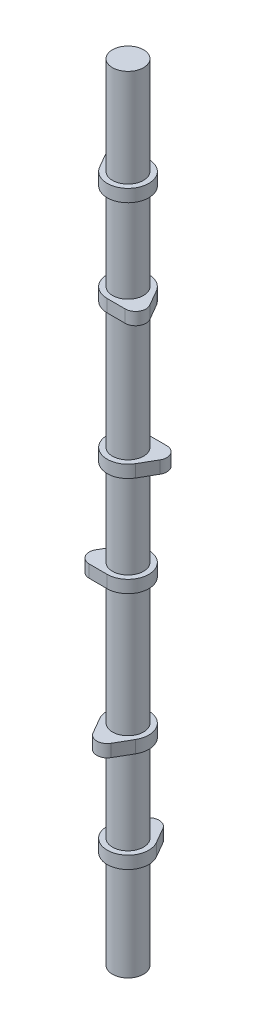
ISO-10303-21;
HEADER;
FILE_DESCRIPTION(('STEP AP214'),'2;1');
FILE_NAME('part.step','',(''),(''),'','','');
FILE_SCHEMA(('AUTOMOTIVE_DESIGN { 1 0 10303 214 1 1 1 1 }'));
ENDSEC;
DATA;
#1=APPLICATION_CONTEXT('core data for automotive mechanical design processes');
#2=APPLICATION_PROTOCOL_DEFINITION('international standard','automotive_design',2000,#1);
#3=PRODUCT_CONTEXT('',#1,'mechanical');
#4=PRODUCT('Part','Part','',(#3));
#5=PRODUCT_RELATED_PRODUCT_CATEGORY('part','',(#4));
#6=PRODUCT_DEFINITION_FORMATION('','',#4);
#7=PRODUCT_DEFINITION_CONTEXT('part definition',#1,'design');
#8=PRODUCT_DEFINITION('design','',#6,#7);
#9=PRODUCT_DEFINITION_SHAPE('','',#8);
#10=(LENGTH_UNIT() NAMED_UNIT(*) SI_UNIT(.MILLI.,.METRE.));
#11=(NAMED_UNIT(*) PLANE_ANGLE_UNIT() SI_UNIT($,.RADIAN.));
#12=(NAMED_UNIT(*) SI_UNIT($,.STERADIAN.) SOLID_ANGLE_UNIT());
#13=UNCERTAINTY_MEASURE_WITH_UNIT(LENGTH_MEASURE(1.E-05),#10,'distance_accuracy_value','');
#14=(GEOMETRIC_REPRESENTATION_CONTEXT(3) GLOBAL_UNCERTAINTY_ASSIGNED_CONTEXT((#13)) GLOBAL_UNIT_ASSIGNED_CONTEXT((#10,
#11,#12)) REPRESENTATION_CONTEXT('',''));
#15=CARTESIAN_POINT('',(0.,0.,0.));
#16=DIRECTION('',(0.,0.,1.));
#17=DIRECTION('',(1.,0.,0.));
#18=AXIS2_PLACEMENT_3D('',#15,#16,#17);
#19=CARTESIAN_POINT('',(0.,64.77,12.7));
#20=DIRECTION('',(0.,-1.,0.));
#21=DIRECTION('',(0.,0.,1.));
#22=AXIS2_PLACEMENT_3D('',#19,#20,#21);
#23=CYLINDRICAL_SURFACE('',#22,6.35);
#24=CARTESIAN_POINT('',(0.,57.15,12.7));
#25=DIRECTION('',(0.,1.,0.));
#26=DIRECTION('',(0.,0.,-1.));
#27=AXIS2_PLACEMENT_3D('',#24,#25,#26);
#28=CIRCLE('',#27,6.35);
#29=CARTESIAN_POINT('',(-5.4992613140313,57.15,15.875));
#30=VERTEX_POINT('',#29);
#31=CARTESIAN_POINT('',(5.49926131403107,57.15,15.875));
#32=VERTEX_POINT('',#31);
#33=EDGE_CURVE('E390',#30,#32,#28,.T.);
#34=ORIENTED_EDGE('',*,*,#33,.T.);
#35=DIRECTION('',(0.,-1.,0.));
#36=VECTOR('',#35,1.);
#37=CARTESIAN_POINT('',(5.49926131403107,64.77,15.875));
#38=LINE('',#37,#36);
#39=CARTESIAN_POINT('',(5.49926131403107,64.77,15.875));
#40=VERTEX_POINT('',#39);
#41=EDGE_CURVE('E47',#40,#32,#38,.T.);
#42=ORIENTED_EDGE('',*,*,#41,.F.);
#43=CARTESIAN_POINT('',(0.,64.77,12.7));
#44=DIRECTION('',(0.,1.,0.));
#45=DIRECTION('',(0.,0.,-1.));
#46=AXIS2_PLACEMENT_3D('',#43,#44,#45);
#47=CIRCLE('',#46,6.35);
#48=CARTESIAN_POINT('',(-5.4992613140313,64.77,15.875));
#49=VERTEX_POINT('',#48);
#50=EDGE_CURVE('E391',#49,#40,#47,.T.);
#51=ORIENTED_EDGE('',*,*,#50,.F.);
#52=DIRECTION('',(0.,-1.,0.));
#53=VECTOR('',#52,1.);
#54=CARTESIAN_POINT('',(-5.4992613140313,64.77,15.875));
#55=LINE('',#54,#53);
#56=EDGE_CURVE('E397',#49,#30,#55,.T.);
#57=ORIENTED_EDGE('',*,*,#56,.T.);
#58=EDGE_LOOP('',(#34,#42,#51,#57));
#59=FACE_BOUND('',#58,.T.);
#60=ADVANCED_FACE('F39',(#59),#23,.T.);
#61=CARTESIAN_POINT('',(5.49926131403107,64.77,15.875));
#62=DIRECTION('',(-0.866025403784435,0.,-0.500000000000006));
#63=DIRECTION('',(-0.500000000000006,0.,0.866025403784435));
#64=AXIS2_PLACEMENT_3D('',#61,#62,#63);
#65=PLANE('',#64);
#66=DIRECTION('',(0.500000000000006,0.,-0.866025403784435));
#67=VECTOR('',#66,1.);
#68=CARTESIAN_POINT('',(5.49926131403107,57.15,15.875));
#69=LINE('',#68,#67);
#70=CARTESIAN_POINT('',(10.9985226280623,57.15,6.35000000000008));
#71=VERTEX_POINT('',#70);
#72=EDGE_CURVE('E400',#32,#71,#69,.T.);
#73=ORIENTED_EDGE('',*,*,#72,.T.);
#74=DIRECTION('',(0.,-1.,0.));
#75=VECTOR('',#74,1.);
#76=CARTESIAN_POINT('',(10.9985226280623,64.77,6.35000000000008));
#77=LINE('',#76,#75);
#78=CARTESIAN_POINT('',(10.9985226280623,64.77,6.35000000000008));
#79=VERTEX_POINT('',#78);
#80=EDGE_CURVE('E407',#79,#71,#77,.T.);
#81=ORIENTED_EDGE('',*,*,#80,.F.);
#82=DIRECTION('',(0.500000000000006,0.,-0.866025403784435));
#83=VECTOR('',#82,1.);
#84=CARTESIAN_POINT('',(5.49926131403107,64.77,15.875));
#85=LINE('',#84,#83);
#86=EDGE_CURVE('E87',#40,#79,#85,.T.);
#87=ORIENTED_EDGE('',*,*,#86,.F.);
#88=ORIENTED_EDGE('',*,*,#41,.T.);
#89=EDGE_LOOP('',(#73,#81,#87,#88));
#90=FACE_BOUND('',#89,.T.);
#91=ADVANCED_FACE('F409',(#90),#65,.F.);
#92=CARTESIAN_POINT('',(0.,64.77,0.));
#93=DIRECTION('',(0.,-1.,0.));
#94=DIRECTION('',(0.,0.,1.));
#95=AXIS2_PLACEMENT_3D('',#92,#93,#94);
#96=CYLINDRICAL_SURFACE('',#95,12.7);
#97=CARTESIAN_POINT('',(0.,57.15,0.));
#98=DIRECTION('',(0.,1.,0.));
#99=DIRECTION('',(0.,0.,-1.));
#100=AXIS2_PLACEMENT_3D('',#97,#98,#99);
#101=CIRCLE('',#100,12.7);
#102=CARTESIAN_POINT('',(-10.9985226280624,57.15,6.34999999999992));
#103=VERTEX_POINT('',#102);
#104=EDGE_CURVE('E73',#71,#103,#101,.T.);
#105=ORIENTED_EDGE('',*,*,#104,.T.);
#106=DIRECTION('',(0.,-1.,0.));
#107=VECTOR('',#106,1.);
#108=CARTESIAN_POINT('',(-10.9985226280624,64.77,6.34999999999992));
#109=LINE('',#108,#107);
#110=CARTESIAN_POINT('',(-10.9985226280624,64.77,6.34999999999992));
#111=VERTEX_POINT('',#110);
#112=EDGE_CURVE('E405',#111,#103,#109,.T.);
#113=ORIENTED_EDGE('',*,*,#112,.F.);
#114=CARTESIAN_POINT('',(0.,64.77,0.));
#115=DIRECTION('',(0.,1.,0.));
#116=DIRECTION('',(0.,0.,-1.));
#117=AXIS2_PLACEMENT_3D('',#114,#115,#116);
#118=CIRCLE('',#117,12.7);
#119=EDGE_CURVE('E394',#79,#111,#118,.T.);
#120=ORIENTED_EDGE('',*,*,#119,.F.);
#121=ORIENTED_EDGE('',*,*,#80,.T.);
#122=EDGE_LOOP('',(#105,#113,#120,#121));
#123=FACE_BOUND('',#122,.T.);
#124=ADVANCED_FACE('F436',(#123),#96,.T.);
#125=CARTESIAN_POINT('',(-5.4992613140313,64.77,15.875));
#126=DIRECTION('',(0.866025403784442,0.,-0.499999999999994));
#127=DIRECTION('',(-0.499999999999994,0.,-0.866025403784442));
#128=AXIS2_PLACEMENT_3D('',#125,#126,#127);
#129=PLANE('',#128);
#130=DIRECTION('',(0.499999999999994,0.,0.866025403784442));
#131=VECTOR('',#130,1.);
#132=CARTESIAN_POINT('',(-5.4992613140313,57.15,15.875));
#133=LINE('',#132,#131);
#134=EDGE_CURVE('E79',#103,#30,#133,.T.);
#135=ORIENTED_EDGE('',*,*,#134,.T.);
#136=ORIENTED_EDGE('',*,*,#56,.F.);
#137=DIRECTION('',(0.499999999999994,0.,0.866025403784442));
#138=VECTOR('',#137,1.);
#139=CARTESIAN_POINT('',(-5.4992613140313,64.77,15.875));
#140=LINE('',#139,#138);
#141=EDGE_CURVE('E55',#111,#49,#140,.T.);
#142=ORIENTED_EDGE('',*,*,#141,.F.);
#143=ORIENTED_EDGE('',*,*,#112,.T.);
#144=EDGE_LOOP('',(#135,#136,#142,#143));
#145=FACE_BOUND('',#144,.T.);
#146=ADVANCED_FACE('F427',(#145),#129,.F.);
#147=CARTESIAN_POINT('',(0.,64.77,12.7));
#148=DIRECTION('',(0.,1.,0.));
#149=DIRECTION('',(0.,0.,-1.));
#150=AXIS2_PLACEMENT_3D('',#147,#148,#149);
#151=PLANE('',#150);
#152=CARTESIAN_POINT('',(0.,64.77,0.));
#153=DIRECTION('',(0.,1.,0.));
#154=DIRECTION('',(0.,0.,1.));
#155=AXIS2_PLACEMENT_3D('',#152,#153,#154);
#156=CIRCLE('',#155,9.5);
#157=CARTESIAN_POINT('',(0.,64.77,9.5));
#158=VERTEX_POINT('',#157);
#159=EDGE_CURVE('E387',#158,#158,#156,.F.);
#160=ORIENTED_EDGE('',*,*,#159,.T.);
#161=EDGE_LOOP('',(#160));
#162=FACE_BOUND('',#161,.T.);
#163=ORIENTED_EDGE('',*,*,#50,.T.);
#164=ORIENTED_EDGE('',*,*,#86,.T.);
#165=ORIENTED_EDGE('',*,*,#119,.T.);
#166=ORIENTED_EDGE('',*,*,#141,.T.);
#167=EDGE_LOOP('',(#163,#164,#165,#166));
#168=FACE_BOUND('',#167,.T.);
#169=ADVANCED_FACE('F417',(#162,#168),#151,.T.);
#170=CARTESIAN_POINT('',(0.,57.15,12.7));
#171=DIRECTION('',(0.,1.,0.));
#172=DIRECTION('',(0.,0.,-1.));
#173=AXIS2_PLACEMENT_3D('',#170,#171,#172);
#174=PLANE('',#173);
#175=CARTESIAN_POINT('',(0.,57.15,0.));
#176=DIRECTION('',(0.,1.,0.));
#177=DIRECTION('',(0.,0.,1.));
#178=AXIS2_PLACEMENT_3D('',#175,#176,#177);
#179=CIRCLE('',#178,9.5);
#180=CARTESIAN_POINT('',(0.,57.15,9.5));
#181=VERTEX_POINT('',#180);
#182=EDGE_CURVE('E11',#181,#181,#179,.F.);
#183=ORIENTED_EDGE('',*,*,#182,.F.);
#184=EDGE_LOOP('',(#183));
#185=FACE_BOUND('',#184,.T.);
#186=ORIENTED_EDGE('',*,*,#33,.F.);
#187=ORIENTED_EDGE('',*,*,#134,.F.);
#188=ORIENTED_EDGE('',*,*,#104,.F.);
#189=ORIENTED_EDGE('',*,*,#72,.F.);
#190=EDGE_LOOP('',(#186,#187,#188,#189));
#191=FACE_BOUND('',#190,.T.);
#192=ADVANCED_FACE('F414',(#185,#191),#174,.F.);
#193=CARTESIAN_POINT('',(0.,-63.5,0.));
#194=DIRECTION('',(0.,1.,0.));
#195=DIRECTION('',(0.,0.,1.));
#196=AXIS2_PLACEMENT_3D('',#193,#194,#195);
#197=PLANE('',#196);
#198=CARTESIAN_POINT('',(0.,-63.5,0.));
#199=DIRECTION('',(0.,1.,0.));
#200=DIRECTION('',(0.,0.,1.));
#201=AXIS2_PLACEMENT_3D('',#198,#199,#200);
#202=CIRCLE('',#201,9.5);
#203=CARTESIAN_POINT('',(0.,-63.5,9.5));
#204=VERTEX_POINT('',#203);
#205=EDGE_CURVE('E982',#204,#204,#202,.T.);
#206=ORIENTED_EDGE('',*,*,#205,.F.);
#207=EDGE_LOOP('',(#206));
#208=FACE_BOUND('',#207,.T.);
#209=ADVANCED_FACE('F416',(#208),#197,.F.);
#210=CARTESIAN_POINT('',(0.,416.56,0.));
#211=DIRECTION('',(0.,-1.,0.));
#212=DIRECTION('',(0.,0.,-1.));
#213=AXIS2_PLACEMENT_3D('',#210,#211,#212);
#214=CYLINDRICAL_SURFACE('',#213,9.5);
#215=ORIENTED_EDGE('',*,*,#205,.T.);
#216=EDGE_LOOP('',(#215));
#217=FACE_BOUND('',#216,.T.);
#218=CARTESIAN_POINT('',(0.,-3.80999999999998,0.));
#219=DIRECTION('',(0.,1.,0.));
#220=DIRECTION('',(0.,0.,1.));
#221=AXIS2_PLACEMENT_3D('',#218,#219,#220);
#222=CIRCLE('',#221,9.5);
#223=CARTESIAN_POINT('',(0.,-3.80999999999998,9.5));
#224=VERTEX_POINT('',#223);
#225=EDGE_CURVE('E235',#224,#224,#222,.F.);
#226=ORIENTED_EDGE('',*,*,#225,.T.);
#227=EDGE_LOOP('',(#226));
#228=FACE_BOUND('',#227,.T.);
#229=ADVANCED_FACE('F424',(#217,#228),#214,.T.);
#230=CARTESIAN_POINT('',(0.,-3.81,-12.7));
#231=DIRECTION('',(0.,1.,0.));
#232=DIRECTION('',(0.,0.,1.));
#233=AXIS2_PLACEMENT_3D('',#230,#231,#232);
#234=PLANE('',#233);
#235=ORIENTED_EDGE('',*,*,#225,.F.);
#236=EDGE_LOOP('',(#235));
#237=FACE_BOUND('',#236,.T.);
#238=CARTESIAN_POINT('',(0.,-3.81,-12.7));
#239=DIRECTION('',(0.,1.,0.));
#240=DIRECTION('',(0.,0.,1.));
#241=AXIS2_PLACEMENT_3D('',#238,#239,#240);
#242=CIRCLE('',#241,6.35);
#243=CARTESIAN_POINT('',(5.49926131403118,-3.81,-15.875));
#244=VERTEX_POINT('',#243);
#245=CARTESIAN_POINT('',(-5.49926131403118,-3.81,-15.875));
#246=VERTEX_POINT('',#245);
#247=EDGE_CURVE('E234',#244,#246,#242,.T.);
#248=ORIENTED_EDGE('',*,*,#247,.F.);
#249=DIRECTION('',(-0.5,0.,-0.866025403784439));
#250=VECTOR('',#249,1.);
#251=CARTESIAN_POINT('',(5.49926131403118,-3.81,-15.875));
#252=LINE('',#251,#250);
#253=CARTESIAN_POINT('',(10.9985226280624,-3.81,-6.35));
#254=VERTEX_POINT('',#253);
#255=EDGE_CURVE('E230',#254,#244,#252,.T.);
#256=ORIENTED_EDGE('',*,*,#255,.F.);
#257=CARTESIAN_POINT('',(0.,-3.81,0.));
#258=DIRECTION('',(0.,1.,0.));
#259=DIRECTION('',(0.,0.,1.));
#260=AXIS2_PLACEMENT_3D('',#257,#258,#259);
#261=CIRCLE('',#260,12.7);
#262=CARTESIAN_POINT('',(-10.9985226280624,-3.81,-6.35000000000001));
#263=VERTEX_POINT('',#262);
#264=EDGE_CURVE('E995',#263,#254,#261,.T.);
#265=ORIENTED_EDGE('',*,*,#264,.F.);
#266=DIRECTION('',(-0.5,0.,0.866025403784439));
#267=VECTOR('',#266,1.);
#268=CARTESIAN_POINT('',(-5.49926131403118,-3.81,-15.875));
#269=LINE('',#268,#267);
#270=EDGE_CURVE('E993',#246,#263,#269,.T.);
#271=ORIENTED_EDGE('',*,*,#270,.F.);
#272=EDGE_LOOP('',(#248,#256,#265,#271));
#273=FACE_BOUND('',#272,.T.);
#274=ADVANCED_FACE('F467',(#237,#273),#234,.F.);
#275=CARTESIAN_POINT('',(5.49926131403118,3.81,-15.875));
#276=DIRECTION('',(-0.866025403784439,0.,0.5));
#277=DIRECTION('',(0.5,0.,0.866025403784439));
#278=AXIS2_PLACEMENT_3D('',#275,#276,#277);
#279=PLANE('',#278);
#280=ORIENTED_EDGE('',*,*,#255,.T.);
#281=DIRECTION('',(0.,-1.,0.));
#282=VECTOR('',#281,1.);
#283=CARTESIAN_POINT('',(5.49926131403118,3.81,-15.875));
#284=LINE('',#283,#282);
#285=CARTESIAN_POINT('',(5.49926131403118,3.81,-15.875));
#286=VERTEX_POINT('',#285);
#287=EDGE_CURVE('E991',#286,#244,#284,.T.);
#288=ORIENTED_EDGE('',*,*,#287,.F.);
#289=DIRECTION('',(-0.5,0.,-0.866025403784439));
#290=VECTOR('',#289,1.);
#291=CARTESIAN_POINT('',(5.49926131403118,3.81,-15.875));
#292=LINE('',#291,#290);
#293=CARTESIAN_POINT('',(10.9985226280624,3.81,-6.35));
#294=VERTEX_POINT('',#293);
#295=EDGE_CURVE('E226',#294,#286,#292,.T.);
#296=ORIENTED_EDGE('',*,*,#295,.F.);
#297=DIRECTION('',(0.,-1.,0.));
#298=VECTOR('',#297,1.);
#299=CARTESIAN_POINT('',(10.9985226280624,3.81,-6.35));
#300=LINE('',#299,#298);
#301=EDGE_CURVE('E240',#294,#254,#300,.T.);
#302=ORIENTED_EDGE('',*,*,#301,.T.);
#303=EDGE_LOOP('',(#280,#288,#296,#302));
#304=FACE_BOUND('',#303,.T.);
#305=ADVANCED_FACE('F478',(#304),#279,.F.);
#306=CARTESIAN_POINT('',(0.,3.81,0.));
#307=DIRECTION('',(0.,-1.,0.));
#308=DIRECTION('',(0.,0.,-1.));
#309=AXIS2_PLACEMENT_3D('',#306,#307,#308);
#310=CYLINDRICAL_SURFACE('',#309,12.7);
#311=ORIENTED_EDGE('',*,*,#264,.T.);
#312=ORIENTED_EDGE('',*,*,#301,.F.);
#313=CARTESIAN_POINT('',(0.,3.81,0.));
#314=DIRECTION('',(0.,1.,0.));
#315=DIRECTION('',(0.,0.,1.));
#316=AXIS2_PLACEMENT_3D('',#313,#314,#315);
#317=CIRCLE('',#316,12.7);
#318=CARTESIAN_POINT('',(-10.9985226280624,3.81,-6.35000000000001));
#319=VERTEX_POINT('',#318);
#320=EDGE_CURVE('E220',#319,#294,#317,.T.);
#321=ORIENTED_EDGE('',*,*,#320,.F.);
#322=DIRECTION('',(0.,-1.,0.));
#323=VECTOR('',#322,1.);
#324=CARTESIAN_POINT('',(-10.9985226280624,3.81,-6.35000000000001));
#325=LINE('',#324,#323);
#326=EDGE_CURVE('E217',#319,#263,#325,.T.);
#327=ORIENTED_EDGE('',*,*,#326,.T.);
#328=EDGE_LOOP('',(#311,#312,#321,#327));
#329=FACE_BOUND('',#328,.T.);
#330=ADVANCED_FACE('F487',(#329),#310,.T.);
#331=CARTESIAN_POINT('',(-5.49926131403118,3.81,-15.875));
#332=DIRECTION('',(0.866025403784439,0.,0.5));
#333=DIRECTION('',(0.5,0.,-0.866025403784439));
#334=AXIS2_PLACEMENT_3D('',#331,#332,#333);
#335=PLANE('',#334);
#336=ORIENTED_EDGE('',*,*,#270,.T.);
#337=ORIENTED_EDGE('',*,*,#326,.F.);
#338=DIRECTION('',(-0.5,0.,0.866025403784439));
#339=VECTOR('',#338,1.);
#340=CARTESIAN_POINT('',(-5.49926131403118,3.81,-15.875));
#341=LINE('',#340,#339);
#342=CARTESIAN_POINT('',(-5.49926131403118,3.81,-15.875));
#343=VERTEX_POINT('',#342);
#344=EDGE_CURVE('E210',#343,#319,#341,.T.);
#345=ORIENTED_EDGE('',*,*,#344,.F.);
#346=DIRECTION('',(0.,-1.,0.));
#347=VECTOR('',#346,1.);
#348=CARTESIAN_POINT('',(-5.49926131403118,3.81,-15.875));
#349=LINE('',#348,#347);
#350=EDGE_CURVE('E214',#343,#246,#349,.T.);
#351=ORIENTED_EDGE('',*,*,#350,.T.);
#352=EDGE_LOOP('',(#336,#337,#345,#351));
#353=FACE_BOUND('',#352,.T.);
#354=ADVANCED_FACE('F212',(#353),#335,.F.);
#355=CARTESIAN_POINT('',(0.,3.81,-12.7));
#356=DIRECTION('',(0.,-1.,0.));
#357=DIRECTION('',(0.,0.,-1.));
#358=AXIS2_PLACEMENT_3D('',#355,#356,#357);
#359=CYLINDRICAL_SURFACE('',#358,6.35);
#360=ORIENTED_EDGE('',*,*,#247,.T.);
#361=ORIENTED_EDGE('',*,*,#350,.F.);
#362=CARTESIAN_POINT('',(0.,3.81,-12.7));
#363=DIRECTION('',(0.,1.,0.));
#364=DIRECTION('',(0.,0.,1.));
#365=AXIS2_PLACEMENT_3D('',#362,#363,#364);
#366=CIRCLE('',#365,6.35);
#367=EDGE_CURVE('E221',#286,#343,#366,.T.);
#368=ORIENTED_EDGE('',*,*,#367,.F.);
#369=ORIENTED_EDGE('',*,*,#287,.T.);
#370=EDGE_LOOP('',(#360,#361,#368,#369));
#371=FACE_BOUND('',#370,.T.);
#372=ADVANCED_FACE('F232',(#371),#359,.T.);
#373=CARTESIAN_POINT('',(0.,3.81,-12.7));
#374=DIRECTION('',(0.,1.,0.));
#375=DIRECTION('',(0.,0.,1.));
#376=AXIS2_PLACEMENT_3D('',#373,#374,#375);
#377=PLANE('',#376);
#378=CARTESIAN_POINT('',(0.,3.80999999999998,0.));
#379=DIRECTION('',(0.,1.,0.));
#380=DIRECTION('',(0.,0.,1.));
#381=AXIS2_PLACEMENT_3D('',#378,#379,#380);
#382=CIRCLE('',#381,9.5);
#383=CARTESIAN_POINT('',(0.,3.80999999999998,9.5));
#384=VERTEX_POINT('',#383);
#385=EDGE_CURVE('E981',#384,#384,#382,.F.);
#386=ORIENTED_EDGE('',*,*,#385,.T.);
#387=EDGE_LOOP('',(#386));
#388=FACE_BOUND('',#387,.T.);
#389=ORIENTED_EDGE('',*,*,#367,.T.);
#390=ORIENTED_EDGE('',*,*,#344,.T.);
#391=ORIENTED_EDGE('',*,*,#320,.T.);
#392=ORIENTED_EDGE('',*,*,#295,.T.);
#393=EDGE_LOOP('',(#389,#390,#391,#392));
#394=FACE_BOUND('',#393,.T.);
#395=ADVANCED_FACE('F224',(#388,#394),#377,.T.);
#396=ORIENTED_EDGE('',*,*,#385,.F.);
#397=EDGE_LOOP('',(#396));
#398=FACE_BOUND('',#397,.T.);
#399=ORIENTED_EDGE('',*,*,#182,.T.);
#400=EDGE_LOOP('',(#399));
#401=FACE_BOUND('',#400,.T.);
#402=ADVANCED_FACE('F518',(#398,#401),#214,.T.);
#403=CARTESIAN_POINT('',(10.9985226280624,210.82,-6.34999999999997));
#404=DIRECTION('',(0.,-1.,0.));
#405=DIRECTION('',(0.86602540378444,0.,-0.499999999999998));
#406=AXIS2_PLACEMENT_3D('',#403,#404,#405);
#407=CYLINDRICAL_SURFACE('',#406,6.35);
#408=CARTESIAN_POINT('',(10.9985226280624,203.2,-6.34999999999997));
#409=DIRECTION('',(0.,1.,0.));
#410=DIRECTION('',(-0.86602540378444,0.,0.499999999999998));
#411=AXIS2_PLACEMENT_3D('',#408,#409,#410);
#412=CIRCLE('',#411,6.35);
#413=CARTESIAN_POINT('',(16.4977839420936,203.2,-3.17499999999996));
#414=VERTEX_POINT('',#413);
#415=CARTESIAN_POINT('',(10.9985226280624,203.2,-12.7));
#416=VERTEX_POINT('',#415);
#417=EDGE_CURVE('E354',#414,#416,#412,.T.);
#418=ORIENTED_EDGE('',*,*,#417,.T.);
#419=DIRECTION('',(0.,-1.,0.));
#420=VECTOR('',#419,1.);
#421=CARTESIAN_POINT('',(10.9985226280624,210.82,-12.7));
#422=LINE('',#421,#420);
#423=CARTESIAN_POINT('',(10.9985226280624,210.82,-12.7));
#424=VERTEX_POINT('',#423);
#425=EDGE_CURVE('E381',#424,#416,#422,.T.);
#426=ORIENTED_EDGE('',*,*,#425,.F.);
#427=CARTESIAN_POINT('',(10.9985226280624,210.82,-6.34999999999997));
#428=DIRECTION('',(0.,1.,0.));
#429=DIRECTION('',(-0.86602540378444,0.,0.499999999999998));
#430=AXIS2_PLACEMENT_3D('',#427,#428,#429);
#431=CIRCLE('',#430,6.35);
#432=CARTESIAN_POINT('',(16.4977839420936,210.82,-3.17499999999996));
#433=VERTEX_POINT('',#432);
#434=EDGE_CURVE('E355',#433,#424,#431,.T.);
#435=ORIENTED_EDGE('',*,*,#434,.F.);
#436=DIRECTION('',(0.,-1.,0.));
#437=VECTOR('',#436,1.);
#438=CARTESIAN_POINT('',(16.4977839420936,210.82,-3.17499999999996));
#439=LINE('',#438,#437);
#440=EDGE_CURVE('E365',#433,#414,#439,.T.);
#441=ORIENTED_EDGE('',*,*,#440,.T.);
#442=EDGE_LOOP('',(#418,#426,#435,#441));
#443=FACE_BOUND('',#442,.T.);
#444=ADVANCED_FACE('F527',(#443),#407,.T.);
#445=CARTESIAN_POINT('',(10.9985226280624,210.82,-12.7));
#446=DIRECTION('',(0.,0.,1.));
#447=DIRECTION('',(1.,0.,0.));
#448=AXIS2_PLACEMENT_3D('',#445,#446,#447);
#449=PLANE('',#448);
#450=DIRECTION('',(-1.,0.,0.));
#451=VECTOR('',#450,1.);
#452=CARTESIAN_POINT('',(10.9985226280624,203.2,-12.7));
#453=LINE('',#452,#451);
#454=CARTESIAN_POINT('',(0.,203.2,-12.7));
#455=VERTEX_POINT('',#454);
#456=EDGE_CURVE('E368',#416,#455,#453,.T.);
#457=ORIENTED_EDGE('',*,*,#456,.T.);
#458=DIRECTION('',(0.,-1.,0.));
#459=VECTOR('',#458,1.);
#460=CARTESIAN_POINT('',(0.,210.82,-12.7));
#461=LINE('',#460,#459);
#462=CARTESIAN_POINT('',(0.,210.82,-12.7));
#463=VERTEX_POINT('',#462);
#464=EDGE_CURVE('E378',#463,#455,#461,.T.);
#465=ORIENTED_EDGE('',*,*,#464,.F.);
#466=DIRECTION('',(-1.,0.,0.));
#467=VECTOR('',#466,1.);
#468=CARTESIAN_POINT('',(10.9985226280624,210.82,-12.7));
#469=LINE('',#468,#467);
#470=EDGE_CURVE('E358',#424,#463,#469,.T.);
#471=ORIENTED_EDGE('',*,*,#470,.F.);
#472=ORIENTED_EDGE('',*,*,#425,.T.);
#473=EDGE_LOOP('',(#457,#465,#471,#472));
#474=FACE_BOUND('',#473,.T.);
#475=ADVANCED_FACE('F536',(#474),#449,.F.);
#476=CARTESIAN_POINT('',(0.,210.82,0.));
#477=DIRECTION('',(0.,-1.,0.));
#478=DIRECTION('',(0.86602540378444,0.,-0.499999999999998));
#479=AXIS2_PLACEMENT_3D('',#476,#477,#478);
#480=CYLINDRICAL_SURFACE('',#479,12.7);
#481=CARTESIAN_POINT('',(0.,203.2,0.));
#482=DIRECTION('',(0.,1.,0.));
#483=DIRECTION('',(-0.86602540378444,0.,0.499999999999998));
#484=AXIS2_PLACEMENT_3D('',#481,#482,#483);
#485=CIRCLE('',#484,12.7);
#486=CARTESIAN_POINT('',(10.9985226280624,203.2,6.35000000000003));
#487=VERTEX_POINT('',#486);
#488=EDGE_CURVE('E370',#455,#487,#485,.T.);
#489=ORIENTED_EDGE('',*,*,#488,.T.);
#490=DIRECTION('',(0.,-1.,0.));
#491=VECTOR('',#490,1.);
#492=CARTESIAN_POINT('',(10.9985226280624,210.82,6.35000000000003));
#493=LINE('',#492,#491);
#494=CARTESIAN_POINT('',(10.9985226280624,210.82,6.35000000000003));
#495=VERTEX_POINT('',#494);
#496=EDGE_CURVE('E375',#495,#487,#493,.T.);
#497=ORIENTED_EDGE('',*,*,#496,.F.);
#498=CARTESIAN_POINT('',(0.,210.82,0.));
#499=DIRECTION('',(0.,1.,0.));
#500=DIRECTION('',(-0.86602540378444,0.,0.499999999999998));
#501=AXIS2_PLACEMENT_3D('',#498,#499,#500);
#502=CIRCLE('',#501,12.7);
#503=EDGE_CURVE('E361',#463,#495,#502,.T.);
#504=ORIENTED_EDGE('',*,*,#503,.F.);
#505=ORIENTED_EDGE('',*,*,#464,.T.);
#506=EDGE_LOOP('',(#489,#497,#504,#505));
#507=FACE_BOUND('',#506,.T.);
#508=ADVANCED_FACE('F545',(#507),#480,.T.);
#509=CARTESIAN_POINT('',(16.4977839420936,210.82,-3.17499999999996));
#510=DIRECTION('',(-0.866025403784437,0.,-0.500000000000002));
#511=DIRECTION('',(-0.500000000000002,0.,0.866025403784437));
#512=AXIS2_PLACEMENT_3D('',#509,#510,#511);
#513=PLANE('',#512);
#514=DIRECTION('',(0.500000000000002,0.,-0.866025403784437));
#515=VECTOR('',#514,1.);
#516=CARTESIAN_POINT('',(16.4977839420936,203.2,-3.17499999999996));
#517=LINE('',#516,#515);
#518=EDGE_CURVE('E359',#487,#414,#517,.T.);
#519=ORIENTED_EDGE('',*,*,#518,.T.);
#520=ORIENTED_EDGE('',*,*,#440,.F.);
#521=DIRECTION('',(0.500000000000002,0.,-0.866025403784437));
#522=VECTOR('',#521,1.);
#523=CARTESIAN_POINT('',(16.4977839420936,210.82,-3.17499999999996));
#524=LINE('',#523,#522);
#525=EDGE_CURVE('E363',#495,#433,#524,.T.);
#526=ORIENTED_EDGE('',*,*,#525,.F.);
#527=ORIENTED_EDGE('',*,*,#496,.T.);
#528=EDGE_LOOP('',(#519,#520,#526,#527));
#529=FACE_BOUND('',#528,.T.);
#530=ADVANCED_FACE('F554',(#529),#513,.F.);
#531=CARTESIAN_POINT('',(10.9985226280624,210.82,-6.34999999999997));
#532=DIRECTION('',(0.,1.,0.));
#533=DIRECTION('',(-0.86602540378444,0.,0.499999999999998));
#534=AXIS2_PLACEMENT_3D('',#531,#532,#533);
#535=PLANE('',#534);
#536=CARTESIAN_POINT('',(0.,210.82,0.));
#537=DIRECTION('',(0.,1.,0.));
#538=DIRECTION('',(0.,0.,1.));
#539=AXIS2_PLACEMENT_3D('',#536,#537,#538);
#540=CIRCLE('',#539,9.5);
#541=CARTESIAN_POINT('',(0.,210.82,9.5));
#542=VERTEX_POINT('',#541);
#543=EDGE_CURVE('E351',#542,#542,#540,.F.);
#544=ORIENTED_EDGE('',*,*,#543,.T.);
#545=EDGE_LOOP('',(#544));
#546=FACE_BOUND('',#545,.T.);
#547=ORIENTED_EDGE('',*,*,#434,.T.);
#548=ORIENTED_EDGE('',*,*,#470,.T.);
#549=ORIENTED_EDGE('',*,*,#503,.T.);
#550=ORIENTED_EDGE('',*,*,#525,.T.);
#551=EDGE_LOOP('',(#547,#548,#549,#550));
#552=FACE_BOUND('',#551,.T.);
#553=ADVANCED_FACE('F563',(#546,#552),#535,.T.);
#554=CARTESIAN_POINT('',(10.9985226280624,203.2,-6.34999999999997));
#555=DIRECTION('',(0.,1.,0.));
#556=DIRECTION('',(-0.86602540378444,0.,0.499999999999998));
#557=AXIS2_PLACEMENT_3D('',#554,#555,#556);
#558=PLANE('',#557);
#559=CARTESIAN_POINT('',(0.,203.2,0.));
#560=DIRECTION('',(0.,1.,0.));
#561=DIRECTION('',(0.,0.,1.));
#562=AXIS2_PLACEMENT_3D('',#559,#560,#561);
#563=CIRCLE('',#562,9.5);
#564=CARTESIAN_POINT('',(0.,203.2,9.5));
#565=VERTEX_POINT('',#564);
#566=EDGE_CURVE('E384',#565,#565,#563,.F.);
#567=ORIENTED_EDGE('',*,*,#566,.F.);
#568=EDGE_LOOP('',(#567));
#569=FACE_BOUND('',#568,.T.);
#570=ORIENTED_EDGE('',*,*,#417,.F.);
#571=ORIENTED_EDGE('',*,*,#518,.F.);
#572=ORIENTED_EDGE('',*,*,#488,.F.);
#573=ORIENTED_EDGE('',*,*,#456,.F.);
#574=EDGE_LOOP('',(#570,#571,#572,#573));
#575=FACE_BOUND('',#574,.T.);
#576=ADVANCED_FACE('F572',(#569,#575),#558,.F.);
#577=ORIENTED_EDGE('',*,*,#159,.F.);
#578=EDGE_LOOP('',(#577));
#579=FACE_BOUND('',#578,.T.);
#580=CARTESIAN_POINT('',(0.,142.24,0.));
#581=DIRECTION('',(0.,1.,0.));
#582=DIRECTION('',(0.,0.,1.));
#583=AXIS2_PLACEMENT_3D('',#580,#581,#582);
#584=CIRCLE('',#583,9.5);
#585=CARTESIAN_POINT('',(0.,142.24,9.5));
#586=VERTEX_POINT('',#585);
#587=EDGE_CURVE('E348',#586,#586,#584,.F.);
#588=ORIENTED_EDGE('',*,*,#587,.T.);
#589=EDGE_LOOP('',(#588));
#590=FACE_BOUND('',#589,.T.);
#591=ADVANCED_FACE('F581',(#579,#590),#214,.T.);
#592=CARTESIAN_POINT('',(-10.9985226280623,142.24,6.35000000000005));
#593=DIRECTION('',(0.,1.,0.));
#594=DIRECTION('',(0.866025403784436,0.,-0.500000000000004));
#595=AXIS2_PLACEMENT_3D('',#592,#593,#594);
#596=PLANE('',#595);
#597=ORIENTED_EDGE('',*,*,#587,.F.);
#598=EDGE_LOOP('',(#597));
#599=FACE_BOUND('',#598,.T.);
#600=CARTESIAN_POINT('',(-10.9985226280623,142.24,6.35000000000005));
#601=DIRECTION('',(0.,1.,0.));
#602=DIRECTION('',(0.866025403784436,0.,-0.500000000000004));
#603=AXIS2_PLACEMENT_3D('',#600,#601,#602);
#604=CIRCLE('',#603,6.35);
#605=CARTESIAN_POINT('',(-16.4977839420935,142.24,3.17500000000008));
#606=VERTEX_POINT('',#605);
#607=CARTESIAN_POINT('',(-10.9985226280623,142.24,12.7000000000001));
#608=VERTEX_POINT('',#607);
#609=EDGE_CURVE('E318',#606,#608,#604,.T.);
#610=ORIENTED_EDGE('',*,*,#609,.F.);
#611=DIRECTION('',(-0.499999999999996,0.,0.866025403784441));
#612=VECTOR('',#611,1.);
#613=CARTESIAN_POINT('',(-16.4977839420935,142.24,3.17500000000008));
#614=LINE('',#613,#612);
#615=CARTESIAN_POINT('',(-10.9985226280624,142.24,-6.34999999999995));
#616=VERTEX_POINT('',#615);
#617=EDGE_CURVE('E323',#616,#606,#614,.T.);
#618=ORIENTED_EDGE('',*,*,#617,.F.);
#619=CARTESIAN_POINT('',(0.,142.24,0.));
#620=DIRECTION('',(0.,1.,0.));
#621=DIRECTION('',(0.866025403784436,0.,-0.500000000000004));
#622=AXIS2_PLACEMENT_3D('',#619,#620,#621);
#623=CIRCLE('',#622,12.7);
#624=CARTESIAN_POINT('',(0.,142.24,12.7));
#625=VERTEX_POINT('',#624);
#626=EDGE_CURVE('E334',#625,#616,#623,.T.);
#627=ORIENTED_EDGE('',*,*,#626,.F.);
#628=DIRECTION('',(1.,0.,0.));
#629=VECTOR('',#628,1.);
#630=CARTESIAN_POINT('',(-10.9985226280623,142.24,12.7000000000001));
#631=LINE('',#630,#629);
#632=EDGE_CURVE('E332',#608,#625,#631,.T.);
#633=ORIENTED_EDGE('',*,*,#632,.F.);
#634=EDGE_LOOP('',(#610,#618,#627,#633));
#635=FACE_BOUND('',#634,.T.);
#636=ADVANCED_FACE('F590',(#599,#635),#596,.F.);
#637=CARTESIAN_POINT('',(-16.4977839420935,149.86,3.17500000000008));
#638=DIRECTION('',(0.866025403784441,0.,0.499999999999996));
#639=DIRECTION('',(0.499999999999996,0.,-0.866025403784441));
#640=AXIS2_PLACEMENT_3D('',#637,#638,#639);
#641=PLANE('',#640);
#642=ORIENTED_EDGE('',*,*,#617,.T.);
#643=DIRECTION('',(0.,-1.,0.));
#644=VECTOR('',#643,1.);
#645=CARTESIAN_POINT('',(-16.4977839420935,149.86,3.17500000000008));
#646=LINE('',#645,#644);
#647=CARTESIAN_POINT('',(-16.4977839420935,149.86,3.17500000000008));
#648=VERTEX_POINT('',#647);
#649=EDGE_CURVE('E329',#648,#606,#646,.T.);
#650=ORIENTED_EDGE('',*,*,#649,.F.);
#651=DIRECTION('',(-0.499999999999996,0.,0.866025403784441));
#652=VECTOR('',#651,1.);
#653=CARTESIAN_POINT('',(-16.4977839420935,149.86,3.17500000000008));
#654=LINE('',#653,#652);
#655=CARTESIAN_POINT('',(-10.9985226280624,149.86,-6.34999999999995));
#656=VERTEX_POINT('',#655);
#657=EDGE_CURVE('E327',#656,#648,#654,.T.);
#658=ORIENTED_EDGE('',*,*,#657,.F.);
#659=DIRECTION('',(0.,-1.,0.));
#660=VECTOR('',#659,1.);
#661=CARTESIAN_POINT('',(-10.9985226280624,149.86,-6.34999999999995));
#662=LINE('',#661,#660);
#663=EDGE_CURVE('E339',#656,#616,#662,.T.);
#664=ORIENTED_EDGE('',*,*,#663,.T.);
#665=EDGE_LOOP('',(#642,#650,#658,#664));
#666=FACE_BOUND('',#665,.T.);
#667=ADVANCED_FACE('F599',(#666),#641,.F.);
#668=CARTESIAN_POINT('',(0.,149.86,0.));
#669=DIRECTION('',(0.,-1.,0.));
#670=DIRECTION('',(-0.866025403784436,0.,0.500000000000004));
#671=AXIS2_PLACEMENT_3D('',#668,#669,#670);
#672=CYLINDRICAL_SURFACE('',#671,12.7);
#673=ORIENTED_EDGE('',*,*,#626,.T.);
#674=ORIENTED_EDGE('',*,*,#663,.F.);
#675=CARTESIAN_POINT('',(0.,149.86,0.));
#676=DIRECTION('',(0.,1.,0.));
#677=DIRECTION('',(0.866025403784436,0.,-0.500000000000004));
#678=AXIS2_PLACEMENT_3D('',#675,#676,#677);
#679=CIRCLE('',#678,12.7);
#680=CARTESIAN_POINT('',(0.,149.86,12.7));
#681=VERTEX_POINT('',#680);
#682=EDGE_CURVE('E325',#681,#656,#679,.T.);
#683=ORIENTED_EDGE('',*,*,#682,.F.);
#684=DIRECTION('',(0.,-1.,0.));
#685=VECTOR('',#684,1.);
#686=CARTESIAN_POINT('',(0.,149.86,12.7));
#687=LINE('',#686,#685);
#688=EDGE_CURVE('E342',#681,#625,#687,.T.);
#689=ORIENTED_EDGE('',*,*,#688,.T.);
#690=EDGE_LOOP('',(#673,#674,#683,#689));
#691=FACE_BOUND('',#690,.T.);
#692=ADVANCED_FACE('F608',(#691),#672,.T.);
#693=CARTESIAN_POINT('',(-10.9985226280623,149.86,12.7000000000001));
#694=DIRECTION('',(0.,0.,-1.));
#695=DIRECTION('',(-1.,0.,0.));
#696=AXIS2_PLACEMENT_3D('',#693,#694,#695);
#697=PLANE('',#696);
#698=ORIENTED_EDGE('',*,*,#632,.T.);
#699=ORIENTED_EDGE('',*,*,#688,.F.);
#700=DIRECTION('',(1.,0.,0.));
#701=VECTOR('',#700,1.);
#702=CARTESIAN_POINT('',(-10.9985226280623,149.86,12.7000000000001));
#703=LINE('',#702,#701);
#704=CARTESIAN_POINT('',(-10.9985226280623,149.86,12.7000000000001));
#705=VERTEX_POINT('',#704);
#706=EDGE_CURVE('E322',#705,#681,#703,.T.);
#707=ORIENTED_EDGE('',*,*,#706,.F.);
#708=DIRECTION('',(0.,-1.,0.));
#709=VECTOR('',#708,1.);
#710=CARTESIAN_POINT('',(-10.9985226280623,149.86,12.7000000000001));
#711=LINE('',#710,#709);
#712=EDGE_CURVE('E345',#705,#608,#711,.T.);
#713=ORIENTED_EDGE('',*,*,#712,.T.);
#714=EDGE_LOOP('',(#698,#699,#707,#713));
#715=FACE_BOUND('',#714,.T.);
#716=ADVANCED_FACE('F617',(#715),#697,.F.);
#717=CARTESIAN_POINT('',(-10.9985226280623,149.86,6.35000000000005));
#718=DIRECTION('',(0.,-1.,0.));
#719=DIRECTION('',(-0.866025403784436,0.,0.500000000000004));
#720=AXIS2_PLACEMENT_3D('',#717,#718,#719);
#721=CYLINDRICAL_SURFACE('',#720,6.35);
#722=ORIENTED_EDGE('',*,*,#609,.T.);
#723=ORIENTED_EDGE('',*,*,#712,.F.);
#724=CARTESIAN_POINT('',(-10.9985226280623,149.86,6.35000000000005));
#725=DIRECTION('',(0.,1.,0.));
#726=DIRECTION('',(0.866025403784436,0.,-0.500000000000004));
#727=AXIS2_PLACEMENT_3D('',#724,#725,#726);
#728=CIRCLE('',#727,6.35);
#729=EDGE_CURVE('E319',#648,#705,#728,.T.);
#730=ORIENTED_EDGE('',*,*,#729,.F.);
#731=ORIENTED_EDGE('',*,*,#649,.T.);
#732=EDGE_LOOP('',(#722,#723,#730,#731));
#733=FACE_BOUND('',#732,.T.);
#734=ADVANCED_FACE('F626',(#733),#721,.T.);
#735=CARTESIAN_POINT('',(-10.9985226280623,149.86,6.35000000000005));
#736=DIRECTION('',(0.,1.,0.));
#737=DIRECTION('',(0.866025403784436,0.,-0.500000000000004));
#738=AXIS2_PLACEMENT_3D('',#735,#736,#737);
#739=PLANE('',#738);
#740=CARTESIAN_POINT('',(0.,149.86,0.));
#741=DIRECTION('',(0.,1.,0.));
#742=DIRECTION('',(0.,0.,1.));
#743=AXIS2_PLACEMENT_3D('',#740,#741,#742);
#744=CIRCLE('',#743,9.5);
#745=CARTESIAN_POINT('',(0.,149.86,9.5));
#746=VERTEX_POINT('',#745);
#747=EDGE_CURVE('E315',#746,#746,#744,.F.);
#748=ORIENTED_EDGE('',*,*,#747,.T.);
#749=EDGE_LOOP('',(#748));
#750=FACE_BOUND('',#749,.T.);
#751=ORIENTED_EDGE('',*,*,#729,.T.);
#752=ORIENTED_EDGE('',*,*,#706,.T.);
#753=ORIENTED_EDGE('',*,*,#682,.T.);
#754=ORIENTED_EDGE('',*,*,#657,.T.);
#755=EDGE_LOOP('',(#751,#752,#753,#754));
#756=FACE_BOUND('',#755,.T.);
#757=ADVANCED_FACE('F635',(#750,#756),#739,.T.);
#758=ORIENTED_EDGE('',*,*,#747,.F.);
#759=EDGE_LOOP('',(#758));
#760=FACE_BOUND('',#759,.T.);
#761=ORIENTED_EDGE('',*,*,#566,.T.);
#762=EDGE_LOOP('',(#761));
#763=FACE_BOUND('',#762,.T.);
#764=ADVANCED_FACE('F529',(#760,#763),#214,.T.);
#765=CARTESIAN_POINT('',(-10.9985226280623,356.87,-6.35000000000013));
#766=DIRECTION('',(0.,-1.,0.));
#767=DIRECTION('',(-0.866025403784433,0.,-0.50000000000001));
#768=AXIS2_PLACEMENT_3D('',#765,#766,#767);
#769=CYLINDRICAL_SURFACE('',#768,6.35);
#770=CARTESIAN_POINT('',(-10.9985226280623,349.25,-6.35000000000013));
#771=DIRECTION('',(0.,1.,0.));
#772=DIRECTION('',(0.866025403784433,0.,0.50000000000001));
#773=AXIS2_PLACEMENT_3D('',#770,#771,#772);
#774=CIRCLE('',#773,6.35);
#775=CARTESIAN_POINT('',(-10.9985226280622,349.25,-12.7000000000001));
#776=VERTEX_POINT('',#775);
#777=CARTESIAN_POINT('',(-16.4977839420935,349.25,-3.17500000000019));
#778=VERTEX_POINT('',#777);
#779=EDGE_CURVE('E282',#776,#778,#774,.T.);
#780=ORIENTED_EDGE('',*,*,#779,.T.);
#781=DIRECTION('',(0.,-1.,0.));
#782=VECTOR('',#781,1.);
#783=CARTESIAN_POINT('',(-16.4977839420935,356.87,-3.17500000000019));
#784=LINE('',#783,#782);
#785=CARTESIAN_POINT('',(-16.4977839420935,356.87,-3.17500000000019));
#786=VERTEX_POINT('',#785);
#787=EDGE_CURVE('E309',#786,#778,#784,.T.);
#788=ORIENTED_EDGE('',*,*,#787,.F.);
#789=CARTESIAN_POINT('',(-10.9985226280623,356.87,-6.35000000000013));
#790=DIRECTION('',(0.,1.,0.));
#791=DIRECTION('',(0.866025403784433,0.,0.50000000000001));
#792=AXIS2_PLACEMENT_3D('',#789,#790,#791);
#793=CIRCLE('',#792,6.35);
#794=CARTESIAN_POINT('',(-10.9985226280622,356.87,-12.7000000000001));
#795=VERTEX_POINT('',#794);
#796=EDGE_CURVE('E283',#795,#786,#793,.T.);
#797=ORIENTED_EDGE('',*,*,#796,.F.);
#798=DIRECTION('',(0.,-1.,0.));
#799=VECTOR('',#798,1.);
#800=CARTESIAN_POINT('',(-10.9985226280622,356.87,-12.7000000000001));
#801=LINE('',#800,#799);
#802=EDGE_CURVE('E293',#795,#776,#801,.T.);
#803=ORIENTED_EDGE('',*,*,#802,.T.);
#804=EDGE_LOOP('',(#780,#788,#797,#803));
#805=FACE_BOUND('',#804,.T.);
#806=ADVANCED_FACE('F652',(#805),#769,.T.);
#807=CARTESIAN_POINT('',(-16.4977839420935,356.87,-3.17500000000019));
#808=DIRECTION('',(0.866025403784445,0.,-0.49999999999999));
#809=DIRECTION('',(-0.49999999999999,0.,-0.866025403784445));
#810=AXIS2_PLACEMENT_3D('',#807,#808,#809);
#811=PLANE('',#810);
#812=DIRECTION('',(0.49999999999999,0.,0.866025403784445));
#813=VECTOR('',#812,1.);
#814=CARTESIAN_POINT('',(-16.4977839420935,349.25,-3.17500000000019));
#815=LINE('',#814,#813);
#816=CARTESIAN_POINT('',(-10.9985226280624,349.25,6.34999999999987));
#817=VERTEX_POINT('',#816);
#818=EDGE_CURVE('E296',#778,#817,#815,.T.);
#819=ORIENTED_EDGE('',*,*,#818,.T.);
#820=DIRECTION('',(0.,-1.,0.));
#821=VECTOR('',#820,1.);
#822=CARTESIAN_POINT('',(-10.9985226280624,356.87,6.34999999999987));
#823=LINE('',#822,#821);
#824=CARTESIAN_POINT('',(-10.9985226280624,356.87,6.34999999999987));
#825=VERTEX_POINT('',#824);
#826=EDGE_CURVE('E306',#825,#817,#823,.T.);
#827=ORIENTED_EDGE('',*,*,#826,.F.);
#828=DIRECTION('',(0.49999999999999,0.,0.866025403784445));
#829=VECTOR('',#828,1.);
#830=CARTESIAN_POINT('',(-16.4977839420935,356.87,-3.17500000000019));
#831=LINE('',#830,#829);
#832=EDGE_CURVE('E286',#786,#825,#831,.T.);
#833=ORIENTED_EDGE('',*,*,#832,.F.);
#834=ORIENTED_EDGE('',*,*,#787,.T.);
#835=EDGE_LOOP('',(#819,#827,#833,#834));
#836=FACE_BOUND('',#835,.T.);
#837=ADVANCED_FACE('F660',(#836),#811,.F.);
#838=CARTESIAN_POINT('',(0.,356.87,0.));
#839=DIRECTION('',(0.,-1.,0.));
#840=DIRECTION('',(-0.866025403784433,0.,-0.50000000000001));
#841=AXIS2_PLACEMENT_3D('',#838,#839,#840);
#842=CYLINDRICAL_SURFACE('',#841,12.7);
#843=CARTESIAN_POINT('',(0.,349.25,0.));
#844=DIRECTION('',(0.,1.,0.));
#845=DIRECTION('',(0.866025403784433,0.,0.50000000000001));
#846=AXIS2_PLACEMENT_3D('',#843,#844,#845);
#847=CIRCLE('',#846,12.7);
#848=CARTESIAN_POINT('',(1.4658413372004E-13,349.25,-12.7));
#849=VERTEX_POINT('',#848);
#850=EDGE_CURVE('E298',#817,#849,#847,.T.);
#851=ORIENTED_EDGE('',*,*,#850,.T.);
#852=DIRECTION('',(0.,-1.,0.));
#853=VECTOR('',#852,1.);
#854=CARTESIAN_POINT('',(1.4658413372004E-13,356.87,-12.7));
#855=LINE('',#854,#853);
#856=CARTESIAN_POINT('',(1.4658413372004E-13,356.87,-12.7));
#857=VERTEX_POINT('',#856);
#858=EDGE_CURVE('E303',#857,#849,#855,.T.);
#859=ORIENTED_EDGE('',*,*,#858,.F.);
#860=CARTESIAN_POINT('',(0.,356.87,0.));
#861=DIRECTION('',(0.,1.,0.));
#862=DIRECTION('',(0.866025403784433,0.,0.50000000000001));
#863=AXIS2_PLACEMENT_3D('',#860,#861,#862);
#864=CIRCLE('',#863,12.7);
#865=EDGE_CURVE('E289',#825,#857,#864,.T.);
#866=ORIENTED_EDGE('',*,*,#865,.F.);
#867=ORIENTED_EDGE('',*,*,#826,.T.);
#868=EDGE_LOOP('',(#851,#859,#866,#867));
#869=FACE_BOUND('',#868,.T.);
#870=ADVANCED_FACE('F669',(#869),#842,.T.);
#871=CARTESIAN_POINT('',(-10.9985226280622,356.87,-12.7000000000001));
#872=DIRECTION('',(0.,0.,1.));
#873=DIRECTION('',(1.,0.,0.));
#874=AXIS2_PLACEMENT_3D('',#871,#872,#873);
#875=PLANE('',#874);
#876=DIRECTION('',(-1.,0.,0.));
#877=VECTOR('',#876,1.);
#878=CARTESIAN_POINT('',(-10.9985226280622,349.25,-12.7000000000001));
#879=LINE('',#878,#877);
#880=EDGE_CURVE('E287',#849,#776,#879,.T.);
#881=ORIENTED_EDGE('',*,*,#880,.T.);
#882=ORIENTED_EDGE('',*,*,#802,.F.);
#883=DIRECTION('',(-1.,0.,0.));
#884=VECTOR('',#883,1.);
#885=CARTESIAN_POINT('',(-10.9985226280622,356.87,-12.7000000000001));
#886=LINE('',#885,#884);
#887=EDGE_CURVE('E291',#857,#795,#886,.T.);
#888=ORIENTED_EDGE('',*,*,#887,.F.);
#889=ORIENTED_EDGE('',*,*,#858,.T.);
#890=EDGE_LOOP('',(#881,#882,#888,#889));
#891=FACE_BOUND('',#890,.T.);
#892=ADVANCED_FACE('F678',(#891),#875,.F.);
#893=CARTESIAN_POINT('',(-10.9985226280623,356.87,-6.35000000000013));
#894=DIRECTION('',(0.,1.,0.));
#895=DIRECTION('',(0.866025403784433,0.,0.50000000000001));
#896=AXIS2_PLACEMENT_3D('',#893,#894,#895);
#897=PLANE('',#896);
#898=CARTESIAN_POINT('',(0.,356.87,0.));
#899=DIRECTION('',(0.,1.,0.));
#900=DIRECTION('',(0.,0.,1.));
#901=AXIS2_PLACEMENT_3D('',#898,#899,#900);
#902=CIRCLE('',#901,9.5);
#903=CARTESIAN_POINT('',(0.,356.87,9.5));
#904=VERTEX_POINT('',#903);
#905=EDGE_CURVE('E279',#904,#904,#902,.F.);
#906=ORIENTED_EDGE('',*,*,#905,.T.);
#907=EDGE_LOOP('',(#906));
#908=FACE_BOUND('',#907,.T.);
#909=ORIENTED_EDGE('',*,*,#796,.T.);
#910=ORIENTED_EDGE('',*,*,#832,.T.);
#911=ORIENTED_EDGE('',*,*,#865,.T.);
#912=ORIENTED_EDGE('',*,*,#887,.T.);
#913=EDGE_LOOP('',(#909,#910,#911,#912));
#914=FACE_BOUND('',#913,.T.);
#915=ADVANCED_FACE('F687',(#908,#914),#897,.T.);
#916=CARTESIAN_POINT('',(-10.9985226280623,349.25,-6.35000000000013));
#917=DIRECTION('',(0.,1.,0.));
#918=DIRECTION('',(0.866025403784433,0.,0.50000000000001));
#919=AXIS2_PLACEMENT_3D('',#916,#917,#918);
#920=PLANE('',#919);
#921=CARTESIAN_POINT('',(0.,349.25,0.));
#922=DIRECTION('',(0.,1.,0.));
#923=DIRECTION('',(0.,0.,1.));
#924=AXIS2_PLACEMENT_3D('',#921,#922,#923);
#925=CIRCLE('',#924,9.5);
#926=CARTESIAN_POINT('',(0.,349.25,9.5));
#927=VERTEX_POINT('',#926);
#928=EDGE_CURVE('E312',#927,#927,#925,.F.);
#929=ORIENTED_EDGE('',*,*,#928,.F.);
#930=EDGE_LOOP('',(#929));
#931=FACE_BOUND('',#930,.T.);
#932=ORIENTED_EDGE('',*,*,#779,.F.);
#933=ORIENTED_EDGE('',*,*,#880,.F.);
#934=ORIENTED_EDGE('',*,*,#850,.F.);
#935=ORIENTED_EDGE('',*,*,#818,.F.);
#936=EDGE_LOOP('',(#932,#933,#934,#935));
#937=FACE_BOUND('',#936,.T.);
#938=ADVANCED_FACE('F696',(#931,#937),#920,.F.);
#939=ORIENTED_EDGE('',*,*,#543,.F.);
#940=EDGE_LOOP('',(#939));
#941=FACE_BOUND('',#940,.T.);
#942=CARTESIAN_POINT('',(0.,288.29,0.));
#943=DIRECTION('',(0.,1.,0.));
#944=DIRECTION('',(0.,0.,1.));
#945=AXIS2_PLACEMENT_3D('',#942,#943,#944);
#946=CIRCLE('',#945,9.5);
#947=CARTESIAN_POINT('',(0.,288.29,9.5));
#948=VERTEX_POINT('',#947);
#949=EDGE_CURVE('E276',#948,#948,#946,.F.);
#950=ORIENTED_EDGE('',*,*,#949,.T.);
#951=EDGE_LOOP('',(#950));
#952=FACE_BOUND('',#951,.T.);
#953=ADVANCED_FACE('F471',(#941,#952),#214,.T.);
#954=CARTESIAN_POINT('',(10.9985226280623,288.29,6.35000000000005));
#955=DIRECTION('',(0.,1.,0.));
#956=DIRECTION('',(-0.866025403784436,0.,-0.500000000000004));
#957=AXIS2_PLACEMENT_3D('',#954,#955,#956);
#958=PLANE('',#957);
#959=ORIENTED_EDGE('',*,*,#949,.F.);
#960=EDGE_LOOP('',(#959));
#961=FACE_BOUND('',#960,.T.);
#962=CARTESIAN_POINT('',(10.9985226280623,288.29,6.35000000000005));
#963=DIRECTION('',(0.,1.,0.));
#964=DIRECTION('',(-0.866025403784436,0.,-0.500000000000004));
#965=AXIS2_PLACEMENT_3D('',#962,#963,#964);
#966=CIRCLE('',#965,6.35);
#967=CARTESIAN_POINT('',(10.9985226280623,288.29,12.7000000000001));
#968=VERTEX_POINT('',#967);
#969=CARTESIAN_POINT('',(16.4977839420935,288.29,3.17500000000008));
#970=VERTEX_POINT('',#969);
#971=EDGE_CURVE('E246',#968,#970,#966,.T.);
#972=ORIENTED_EDGE('',*,*,#971,.F.);
#973=DIRECTION('',(1.,0.,0.));
#974=VECTOR('',#973,1.);
#975=CARTESIAN_POINT('',(10.9985226280623,288.29,12.7000000000001));
#976=LINE('',#975,#974);
#977=CARTESIAN_POINT('',(0.,288.29,12.7));
#978=VERTEX_POINT('',#977);
#979=EDGE_CURVE('E251',#978,#968,#976,.T.);
#980=ORIENTED_EDGE('',*,*,#979,.F.);
#981=CARTESIAN_POINT('',(0.,288.29,0.));
#982=DIRECTION('',(0.,1.,0.));
#983=DIRECTION('',(-0.866025403784436,0.,-0.500000000000004));
#984=AXIS2_PLACEMENT_3D('',#981,#982,#983);
#985=CIRCLE('',#984,12.7);
#986=CARTESIAN_POINT('',(10.9985226280624,288.29,-6.34999999999995));
#987=VERTEX_POINT('',#986);
#988=EDGE_CURVE('E262',#987,#978,#985,.T.);
#989=ORIENTED_EDGE('',*,*,#988,.F.);
#990=DIRECTION('',(-0.499999999999996,0.,-0.866025403784441));
#991=VECTOR('',#990,1.);
#992=CARTESIAN_POINT('',(16.4977839420935,288.29,3.17500000000008));
#993=LINE('',#992,#991);
#994=EDGE_CURVE('E260',#970,#987,#993,.T.);
#995=ORIENTED_EDGE('',*,*,#994,.F.);
#996=EDGE_LOOP('',(#972,#980,#989,#995));
#997=FACE_BOUND('',#996,.T.);
#998=ADVANCED_FACE('F713',(#961,#997),#958,.F.);
#999=CARTESIAN_POINT('',(10.9985226280623,295.91,6.35000000000005));
#1000=DIRECTION('',(0.,1.,0.));
#1001=DIRECTION('',(-0.866025403784436,0.,-0.500000000000004));
#1002=AXIS2_PLACEMENT_3D('',#999,#1000,#1001);
#1003=PLANE('',#1002);
#1004=CARTESIAN_POINT('',(0.,295.91,0.));
#1005=DIRECTION('',(0.,1.,0.));
#1006=DIRECTION('',(0.,0.,1.));
#1007=AXIS2_PLACEMENT_3D('',#1004,#1005,#1006);
#1008=CIRCLE('',#1007,9.5);
#1009=CARTESIAN_POINT('',(0.,295.91,9.5));
#1010=VERTEX_POINT('',#1009);
#1011=EDGE_CURVE('E238',#1010,#1010,#1008,.F.);
#1012=ORIENTED_EDGE('',*,*,#1011,.T.);
#1013=EDGE_LOOP('',(#1012));
#1014=FACE_BOUND('',#1013,.T.);
#1015=CARTESIAN_POINT('',(10.9985226280623,295.91,6.35000000000005));
#1016=DIRECTION('',(0.,1.,0.));
#1017=DIRECTION('',(-0.866025403784436,0.,-0.500000000000004));
#1018=AXIS2_PLACEMENT_3D('',#1015,#1016,#1017);
#1019=CIRCLE('',#1018,6.35);
#1020=CARTESIAN_POINT('',(10.9985226280623,295.91,12.7000000000001));
#1021=VERTEX_POINT('',#1020);
#1022=CARTESIAN_POINT('',(16.4977839420935,295.91,3.17500000000008));
#1023=VERTEX_POINT('',#1022);
#1024=EDGE_CURVE('E247',#1021,#1023,#1019,.T.);
#1025=ORIENTED_EDGE('',*,*,#1024,.T.);
#1026=DIRECTION('',(-0.499999999999996,0.,-0.866025403784441));
#1027=VECTOR('',#1026,1.);
#1028=CARTESIAN_POINT('',(16.4977839420935,295.91,3.17500000000008));
#1029=LINE('',#1028,#1027);
#1030=CARTESIAN_POINT('',(10.9985226280624,295.91,-6.34999999999995));
#1031=VERTEX_POINT('',#1030);
#1032=EDGE_CURVE('E250',#1023,#1031,#1029,.T.);
#1033=ORIENTED_EDGE('',*,*,#1032,.T.);
#1034=CARTESIAN_POINT('',(0.,295.91,0.));
#1035=DIRECTION('',(0.,1.,0.));
#1036=DIRECTION('',(-0.866025403784436,0.,-0.500000000000004));
#1037=AXIS2_PLACEMENT_3D('',#1034,#1035,#1036);
#1038=CIRCLE('',#1037,12.7);
#1039=CARTESIAN_POINT('',(0.,295.91,12.7));
#1040=VERTEX_POINT('',#1039);
#1041=EDGE_CURVE('E253',#1031,#1040,#1038,.T.);
#1042=ORIENTED_EDGE('',*,*,#1041,.T.);
#1043=DIRECTION('',(1.,0.,0.));
#1044=VECTOR('',#1043,1.);
#1045=CARTESIAN_POINT('',(10.9985226280623,295.91,12.7000000000001));
#1046=LINE('',#1045,#1044);
#1047=EDGE_CURVE('E255',#1040,#1021,#1046,.T.);
#1048=ORIENTED_EDGE('',*,*,#1047,.T.);
#1049=EDGE_LOOP('',(#1025,#1033,#1042,#1048));
#1050=FACE_BOUND('',#1049,.T.);
#1051=ADVANCED_FACE('F721',(#1014,#1050),#1003,.T.);
#1052=CARTESIAN_POINT('',(10.9985226280623,295.91,12.7000000000001));
#1053=DIRECTION('',(0.,0.,-1.));
#1054=DIRECTION('',(-1.,0.,0.));
#1055=AXIS2_PLACEMENT_3D('',#1052,#1053,#1054);
#1056=PLANE('',#1055);
#1057=ORIENTED_EDGE('',*,*,#979,.T.);
#1058=DIRECTION('',(0.,-1.,0.));
#1059=VECTOR('',#1058,1.);
#1060=CARTESIAN_POINT('',(10.9985226280623,295.91,12.7000000000001));
#1061=LINE('',#1060,#1059);
#1062=EDGE_CURVE('E257',#1021,#968,#1061,.T.);
#1063=ORIENTED_EDGE('',*,*,#1062,.F.);
#1064=ORIENTED_EDGE('',*,*,#1047,.F.);
#1065=DIRECTION('',(0.,-1.,0.));
#1066=VECTOR('',#1065,1.);
#1067=CARTESIAN_POINT('',(0.,295.91,12.7));
#1068=LINE('',#1067,#1066);
#1069=EDGE_CURVE('E267',#1040,#978,#1068,.T.);
#1070=ORIENTED_EDGE('',*,*,#1069,.T.);
#1071=EDGE_LOOP('',(#1057,#1063,#1064,#1070));
#1072=FACE_BOUND('',#1071,.T.);
#1073=ADVANCED_FACE('F730',(#1072),#1056,.F.);
#1074=CARTESIAN_POINT('',(0.,295.91,0.));
#1075=DIRECTION('',(0.,-1.,0.));
#1076=DIRECTION('',(0.866025403784436,0.,0.500000000000004));
#1077=AXIS2_PLACEMENT_3D('',#1074,#1075,#1076);
#1078=CYLINDRICAL_SURFACE('',#1077,12.7);
#1079=ORIENTED_EDGE('',*,*,#988,.T.);
#1080=ORIENTED_EDGE('',*,*,#1069,.F.);
#1081=ORIENTED_EDGE('',*,*,#1041,.F.);
#1082=DIRECTION('',(0.,-1.,0.));
#1083=VECTOR('',#1082,1.);
#1084=CARTESIAN_POINT('',(10.9985226280624,295.91,-6.34999999999995));
#1085=LINE('',#1084,#1083);
#1086=EDGE_CURVE('E270',#1031,#987,#1085,.T.);
#1087=ORIENTED_EDGE('',*,*,#1086,.T.);
#1088=EDGE_LOOP('',(#1079,#1080,#1081,#1087));
#1089=FACE_BOUND('',#1088,.T.);
#1090=ADVANCED_FACE('F739',(#1089),#1078,.T.);
#1091=CARTESIAN_POINT('',(16.4977839420935,295.91,3.17500000000008));
#1092=DIRECTION('',(-0.866025403784441,0.,0.499999999999996));
#1093=DIRECTION('',(0.499999999999996,0.,0.866025403784441));
#1094=AXIS2_PLACEMENT_3D('',#1091,#1092,#1093);
#1095=PLANE('',#1094);
#1096=ORIENTED_EDGE('',*,*,#994,.T.);
#1097=ORIENTED_EDGE('',*,*,#1086,.F.);
#1098=ORIENTED_EDGE('',*,*,#1032,.F.);
#1099=DIRECTION('',(0.,-1.,0.));
#1100=VECTOR('',#1099,1.);
#1101=CARTESIAN_POINT('',(16.4977839420935,295.91,3.17500000000008));
#1102=LINE('',#1101,#1100);
#1103=EDGE_CURVE('E273',#1023,#970,#1102,.T.);
#1104=ORIENTED_EDGE('',*,*,#1103,.T.);
#1105=EDGE_LOOP('',(#1096,#1097,#1098,#1104));
#1106=FACE_BOUND('',#1105,.T.);
#1107=ADVANCED_FACE('F748',(#1106),#1095,.F.);
#1108=CARTESIAN_POINT('',(10.9985226280623,295.91,6.35000000000005));
#1109=DIRECTION('',(0.,-1.,0.));
#1110=DIRECTION('',(0.866025403784436,0.,0.500000000000004));
#1111=AXIS2_PLACEMENT_3D('',#1108,#1109,#1110);
#1112=CYLINDRICAL_SURFACE('',#1111,6.35);
#1113=ORIENTED_EDGE('',*,*,#971,.T.);
#1114=ORIENTED_EDGE('',*,*,#1103,.F.);
#1115=ORIENTED_EDGE('',*,*,#1024,.F.);
#1116=ORIENTED_EDGE('',*,*,#1062,.T.);
#1117=EDGE_LOOP('',(#1113,#1114,#1115,#1116));
#1118=FACE_BOUND('',#1117,.T.);
#1119=ADVANCED_FACE('F757',(#1118),#1112,.T.);
#1120=ORIENTED_EDGE('',*,*,#1011,.F.);
#1121=EDGE_LOOP('',(#1120));
#1122=FACE_BOUND('',#1121,.T.);
#1123=ORIENTED_EDGE('',*,*,#928,.T.);
#1124=EDGE_LOOP('',(#1123));
#1125=FACE_BOUND('',#1124,.T.);
#1126=ADVANCED_FACE('F592',(#1122,#1125),#214,.T.);
#1127=ORIENTED_EDGE('',*,*,#905,.F.);
#1128=EDGE_LOOP('',(#1127));
#1129=FACE_BOUND('',#1128,.T.);
#1130=CARTESIAN_POINT('',(0.,416.56,0.));
#1131=DIRECTION('',(0.,1.,0.));
#1132=DIRECTION('',(0.,0.,1.));
#1133=AXIS2_PLACEMENT_3D('',#1130,#1131,#1132);
#1134=CIRCLE('',#1133,9.5);
#1135=CARTESIAN_POINT('',(0.,416.56,9.5));
#1136=VERTEX_POINT('',#1135);
#1137=EDGE_CURVE('E979',#1136,#1136,#1134,.T.);
#1138=ORIENTED_EDGE('',*,*,#1137,.F.);
#1139=EDGE_LOOP('',(#1138));
#1140=FACE_BOUND('',#1139,.T.);
#1141=ADVANCED_FACE('F470',(#1129,#1140),#214,.T.);
#1142=CARTESIAN_POINT('',(0.,416.56,0.));
#1143=DIRECTION('',(0.,1.,0.));
#1144=DIRECTION('',(0.,0.,1.));
#1145=AXIS2_PLACEMENT_3D('',#1142,#1143,#1144);
#1146=PLANE('',#1145);
#1147=ORIENTED_EDGE('',*,*,#1137,.T.);
#1148=EDGE_LOOP('',(#1147));
#1149=FACE_BOUND('',#1148,.T.);
#1150=ADVANCED_FACE('F781',(#1149),#1146,.T.);
#1151=CLOSED_SHELL('',(#60,#91,#124,#146,#169,#192,#209,#229,#274,#305,#330,#354,#372,#395,#402,
#444,#475,#508,#530,#553,#576,#591,#636,#667,#692,#716,#734,#757,#764,#806,#837,#870,#892,#915,
#938,#953,#998,#1051,#1073,#1090,#1107,#1119,#1126,#1141,#1150));
#1152=MANIFOLD_SOLID_BREP('B2',#1151);
#1153=ADVANCED_BREP_SHAPE_REPRESENTATION('',(#18,#1152),#14);
#1154=SHAPE_DEFINITION_REPRESENTATION(#9,#1153);
ENDSEC;
END-ISO-10303-21;
